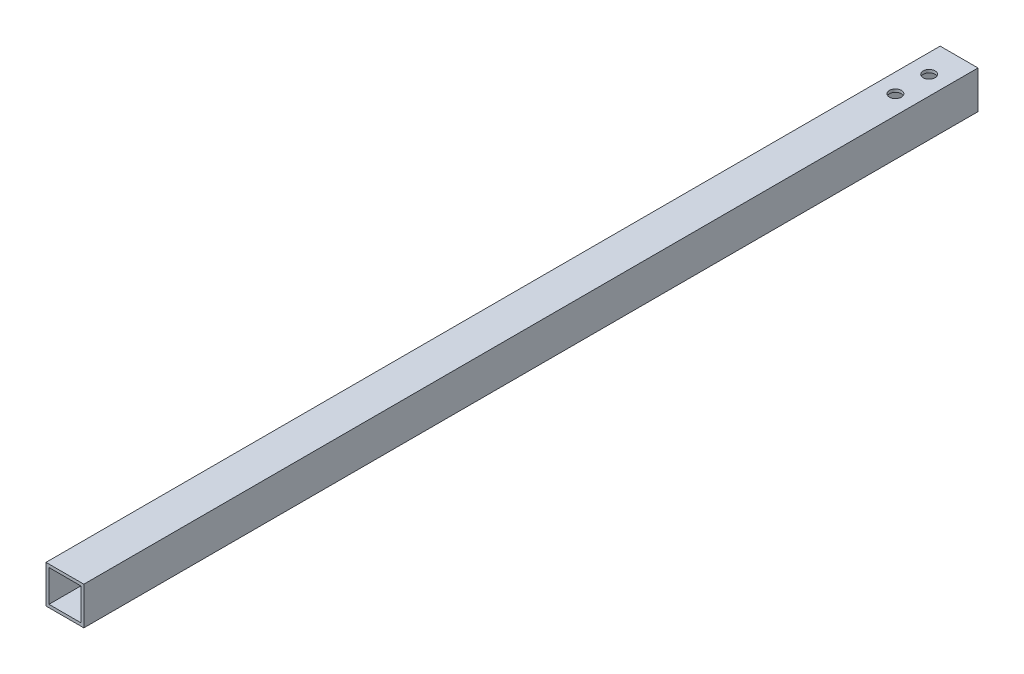
ISO-10303-21;
HEADER;
FILE_DESCRIPTION(('STEP AP214'),'2;1');
FILE_NAME('part.step','',(''),(''),'','','');
FILE_SCHEMA(('AUTOMOTIVE_DESIGN { 1 0 10303 214 1 1 1 1 }'));
ENDSEC;
DATA;
#1=APPLICATION_CONTEXT('core data for automotive mechanical design processes');
#2=APPLICATION_PROTOCOL_DEFINITION('international standard','automotive_design',2000,#1);
#3=PRODUCT_CONTEXT('',#1,'mechanical');
#4=PRODUCT('Part','Part','',(#3));
#5=PRODUCT_RELATED_PRODUCT_CATEGORY('part','',(#4));
#6=PRODUCT_DEFINITION_FORMATION('','',#4);
#7=PRODUCT_DEFINITION_CONTEXT('part definition',#1,'design');
#8=PRODUCT_DEFINITION('design','',#6,#7);
#9=PRODUCT_DEFINITION_SHAPE('','',#8);
#10=(LENGTH_UNIT() NAMED_UNIT(*) SI_UNIT(.MILLI.,.METRE.));
#11=(NAMED_UNIT(*) PLANE_ANGLE_UNIT() SI_UNIT($,.RADIAN.));
#12=(NAMED_UNIT(*) SI_UNIT($,.STERADIAN.) SOLID_ANGLE_UNIT());
#13=UNCERTAINTY_MEASURE_WITH_UNIT(LENGTH_MEASURE(1.E-05),#10,'distance_accuracy_value','');
#14=(GEOMETRIC_REPRESENTATION_CONTEXT(3) GLOBAL_UNCERTAINTY_ASSIGNED_CONTEXT((#13)) GLOBAL_UNIT_ASSIGNED_CONTEXT((#10,
#11,#12)) REPRESENTATION_CONTEXT('',''));
#15=CARTESIAN_POINT('',(0.,0.,0.));
#16=DIRECTION('',(0.,0.,1.));
#17=DIRECTION('',(1.,0.,0.));
#18=AXIS2_PLACEMENT_3D('',#15,#16,#17);
#19=CARTESIAN_POINT('',(-5.91608824086589,5.0490477402939,300.));
#20=DIRECTION('',(0.,1.,0.));
#21=DIRECTION('',(0.,0.,1.));
#22=AXIS2_PLACEMENT_3D('',#19,#20,#21);
#23=PLANE('',#22);
#24=CARTESIAN_POINT('',(0.433911759134113,5.0490477402939,10.0400407018049));
#25=DIRECTION('',(0.,1.,0.));
#26=DIRECTION('',(0.,0.,1.));
#27=AXIS2_PLACEMENT_3D('',#24,#25,#26);
#28=CIRCLE('',#27,2.);
#29=CARTESIAN_POINT('',(0.433911759134113,5.0490477402939,12.0400407018049));
#30=VERTEX_POINT('',#29);
#31=EDGE_CURVE('E165',#30,#30,#28,.T.);
#32=ORIENTED_EDGE('',*,*,#31,.F.);
#33=EDGE_LOOP('',(#32));
#34=FACE_BOUND('',#33,.T.);
#35=CARTESIAN_POINT('',(0.433911759134113,5.0490477402939,21.3484981501908));
#36=DIRECTION('',(0.,1.,0.));
#37=DIRECTION('',(0.,0.,1.));
#38=AXIS2_PLACEMENT_3D('',#35,#36,#37);
#39=CIRCLE('',#38,2.);
#40=CARTESIAN_POINT('',(0.433911759134113,5.0490477402939,23.3484981501908));
#41=VERTEX_POINT('',#40);
#42=EDGE_CURVE('E172',#41,#41,#39,.T.);
#43=ORIENTED_EDGE('',*,*,#42,.F.);
#44=EDGE_LOOP('',(#43));
#45=FACE_BOUND('',#44,.T.);
#46=DIRECTION('',(1.,0.,0.));
#47=VECTOR('',#46,1.);
#48=CARTESIAN_POINT('',(-5.91608824086589,5.0490477402939,0.));
#49=LINE('',#48,#47);
#50=CARTESIAN_POINT('',(-5.91608824086589,5.0490477402939,0.));
#51=VERTEX_POINT('',#50);
#52=CARTESIAN_POINT('',(6.78391175913411,5.0490477402939,0.));
#53=VERTEX_POINT('',#52);
#54=EDGE_CURVE('E148',#51,#53,#49,.T.);
#55=ORIENTED_EDGE('',*,*,#54,.F.);
#56=DIRECTION('',(0.,0.,-1.));
#57=VECTOR('',#56,1.);
#58=CARTESIAN_POINT('',(-5.91608824086589,5.0490477402939,300.));
#59=LINE('',#58,#57);
#60=CARTESIAN_POINT('',(-5.91608824086589,5.0490477402939,300.));
#61=VERTEX_POINT('',#60);
#62=EDGE_CURVE('E11',#61,#51,#59,.T.);
#63=ORIENTED_EDGE('',*,*,#62,.F.);
#64=DIRECTION('',(1.,0.,0.));
#65=VECTOR('',#64,1.);
#66=CARTESIAN_POINT('',(-5.91608824086589,5.0490477402939,300.));
#67=LINE('',#66,#65);
#68=CARTESIAN_POINT('',(6.78391175913411,5.0490477402939,300.));
#69=VERTEX_POINT('',#68);
#70=EDGE_CURVE('E136',#61,#69,#67,.T.);
#71=ORIENTED_EDGE('',*,*,#70,.T.);
#72=DIRECTION('',(0.,0.,-1.));
#73=VECTOR('',#72,1.);
#74=CARTESIAN_POINT('',(6.78391175913411,5.0490477402939,300.));
#75=LINE('',#74,#73);
#76=EDGE_CURVE('E147',#69,#53,#75,.T.);
#77=ORIENTED_EDGE('',*,*,#76,.T.);
#78=EDGE_LOOP('',(#55,#63,#71,#77));
#79=FACE_BOUND('',#78,.T.);
#80=ADVANCED_FACE('F37',(#34,#45,#79),#23,.T.);
#81=CARTESIAN_POINT('',(-5.91608824086589,5.0490477402939,300.));
#82=DIRECTION('',(1.,0.,0.));
#83=DIRECTION('',(0.,1.,0.));
#84=AXIS2_PLACEMENT_3D('',#81,#82,#83);
#85=PLANE('',#84);
#86=DIRECTION('',(0.,-1.,0.));
#87=VECTOR('',#86,1.);
#88=CARTESIAN_POINT('',(-5.91608824086589,5.0490477402939,0.));
#89=LINE('',#88,#87);
#90=CARTESIAN_POINT('',(-5.91608824086589,-7.6509522597061,0.));
#91=VERTEX_POINT('',#90);
#92=EDGE_CURVE('E140',#51,#91,#89,.T.);
#93=ORIENTED_EDGE('',*,*,#92,.T.);
#94=DIRECTION('',(0.,0.,-1.));
#95=VECTOR('',#94,1.);
#96=CARTESIAN_POINT('',(-5.91608824086589,-7.6509522597061,300.));
#97=LINE('',#96,#95);
#98=CARTESIAN_POINT('',(-5.91608824086589,-7.6509522597061,300.));
#99=VERTEX_POINT('',#98);
#100=EDGE_CURVE('E45',#99,#91,#97,.T.);
#101=ORIENTED_EDGE('',*,*,#100,.F.);
#102=DIRECTION('',(0.,-1.,0.));
#103=VECTOR('',#102,1.);
#104=CARTESIAN_POINT('',(-5.91608824086589,5.0490477402939,300.));
#105=LINE('',#104,#103);
#106=EDGE_CURVE('E145',#61,#99,#105,.T.);
#107=ORIENTED_EDGE('',*,*,#106,.F.);
#108=ORIENTED_EDGE('',*,*,#62,.T.);
#109=EDGE_LOOP('',(#93,#101,#107,#108));
#110=FACE_BOUND('',#109,.T.);
#111=ADVANCED_FACE('F207',(#110),#85,.F.);
#112=CARTESIAN_POINT('',(-5.91608824086589,-7.6509522597061,300.));
#113=DIRECTION('',(0.,1.,0.));
#114=DIRECTION('',(0.,0.,1.));
#115=AXIS2_PLACEMENT_3D('',#112,#113,#114);
#116=PLANE('',#115);
#117=CARTESIAN_POINT('',(0.433911759134113,-7.6509522597061,10.0400407018049));
#118=DIRECTION('',(0.,1.,0.));
#119=DIRECTION('',(0.,0.,1.));
#120=AXIS2_PLACEMENT_3D('',#117,#118,#119);
#121=CIRCLE('',#120,2.);
#122=CARTESIAN_POINT('',(0.433911759134113,-7.6509522597061,12.0400407018049));
#123=VERTEX_POINT('',#122);
#124=EDGE_CURVE('E120',#123,#123,#121,.T.);
#125=ORIENTED_EDGE('',*,*,#124,.T.);
#126=EDGE_LOOP('',(#125));
#127=FACE_BOUND('',#126,.T.);
#128=CARTESIAN_POINT('',(0.433911759134113,-7.6509522597061,21.3484981501908));
#129=DIRECTION('',(0.,1.,0.));
#130=DIRECTION('',(0.,0.,1.));
#131=AXIS2_PLACEMENT_3D('',#128,#129,#130);
#132=CIRCLE('',#131,2.);
#133=CARTESIAN_POINT('',(0.433911759134113,-7.6509522597061,23.3484981501908));
#134=VERTEX_POINT('',#133);
#135=EDGE_CURVE('E169',#134,#134,#132,.T.);
#136=ORIENTED_EDGE('',*,*,#135,.T.);
#137=EDGE_LOOP('',(#136));
#138=FACE_BOUND('',#137,.T.);
#139=DIRECTION('',(1.,0.,0.));
#140=VECTOR('',#139,1.);
#141=CARTESIAN_POINT('',(-5.91608824086589,-7.6509522597061,0.));
#142=LINE('',#141,#140);
#143=CARTESIAN_POINT('',(6.78391175913411,-7.6509522597061,0.));
#144=VERTEX_POINT('',#143);
#145=EDGE_CURVE('E154',#91,#144,#142,.T.);
#146=ORIENTED_EDGE('',*,*,#145,.T.);
#147=DIRECTION('',(0.,0.,-1.));
#148=VECTOR('',#147,1.);
#149=CARTESIAN_POINT('',(6.78391175913411,-7.6509522597061,300.));
#150=LINE('',#149,#148);
#151=CARTESIAN_POINT('',(6.78391175913411,-7.6509522597061,300.));
#152=VERTEX_POINT('',#151);
#153=EDGE_CURVE('E160',#152,#144,#150,.T.);
#154=ORIENTED_EDGE('',*,*,#153,.F.);
#155=DIRECTION('',(1.,0.,0.));
#156=VECTOR('',#155,1.);
#157=CARTESIAN_POINT('',(-5.91608824086589,-7.6509522597061,300.));
#158=LINE('',#157,#156);
#159=EDGE_CURVE('E143',#99,#152,#158,.T.);
#160=ORIENTED_EDGE('',*,*,#159,.F.);
#161=ORIENTED_EDGE('',*,*,#100,.T.);
#162=EDGE_LOOP('',(#146,#154,#160,#161));
#163=FACE_BOUND('',#162,.T.);
#164=ADVANCED_FACE('F212',(#127,#138,#163),#116,.F.);
#165=CARTESIAN_POINT('',(6.78391175913411,5.0490477402939,300.));
#166=DIRECTION('',(1.,0.,0.));
#167=DIRECTION('',(0.,0.,-1.));
#168=AXIS2_PLACEMENT_3D('',#165,#166,#167);
#169=PLANE('',#168);
#170=DIRECTION('',(0.,-1.,0.));
#171=VECTOR('',#170,1.);
#172=CARTESIAN_POINT('',(6.78391175913411,5.0490477402939,0.));
#173=LINE('',#172,#171);
#174=EDGE_CURVE('E151',#53,#144,#173,.T.);
#175=ORIENTED_EDGE('',*,*,#174,.F.);
#176=ORIENTED_EDGE('',*,*,#76,.F.);
#177=DIRECTION('',(0.,-1.,0.));
#178=VECTOR('',#177,1.);
#179=CARTESIAN_POINT('',(6.78391175913411,5.0490477402939,300.));
#180=LINE('',#179,#178);
#181=EDGE_CURVE('E139',#69,#152,#180,.T.);
#182=ORIENTED_EDGE('',*,*,#181,.T.);
#183=ORIENTED_EDGE('',*,*,#153,.T.);
#184=EDGE_LOOP('',(#175,#176,#182,#183));
#185=FACE_BOUND('',#184,.T.);
#186=ADVANCED_FACE('F230',(#185),#169,.T.);
#187=CARTESIAN_POINT('',(0.,0.,300.));
#188=DIRECTION('',(0.,0.,-1.));
#189=DIRECTION('',(-1.,0.,0.));
#190=AXIS2_PLACEMENT_3D('',#187,#188,#189);
#191=PLANE('',#190);
#192=DIRECTION('',(0.,-1.,0.));
#193=VECTOR('',#192,1.);
#194=CARTESIAN_POINT('',(-4.91608824086589,0.,300.));
#195=LINE('',#194,#193);
#196=CARTESIAN_POINT('',(-4.91608824086589,4.0490477402939,300.));
#197=VERTEX_POINT('',#196);
#198=CARTESIAN_POINT('',(-4.91608824086589,-6.6509522597061,300.));
#199=VERTEX_POINT('',#198);
#200=EDGE_CURVE('E111',#197,#199,#195,.T.);
#201=ORIENTED_EDGE('',*,*,#200,.F.);
#202=DIRECTION('',(1.,0.,0.));
#203=VECTOR('',#202,1.);
#204=CARTESIAN_POINT('',(0.,4.0490477402939,300.));
#205=LINE('',#204,#203);
#206=CARTESIAN_POINT('',(5.78391175913411,4.0490477402939,300.));
#207=VERTEX_POINT('',#206);
#208=EDGE_CURVE('E130',#197,#207,#205,.T.);
#209=ORIENTED_EDGE('',*,*,#208,.T.);
#210=DIRECTION('',(0.,-1.,0.));
#211=VECTOR('',#210,1.);
#212=CARTESIAN_POINT('',(5.78391175913411,0.,300.));
#213=LINE('',#212,#211);
#214=CARTESIAN_POINT('',(5.78391175913411,-6.6509522597061,300.));
#215=VERTEX_POINT('',#214);
#216=EDGE_CURVE('E107',#207,#215,#213,.T.);
#217=ORIENTED_EDGE('',*,*,#216,.T.);
#218=DIRECTION('',(1.,0.,0.));
#219=VECTOR('',#218,1.);
#220=CARTESIAN_POINT('',(0.,-6.6509522597061,300.));
#221=LINE('',#220,#219);
#222=EDGE_CURVE('E133',#199,#215,#221,.T.);
#223=ORIENTED_EDGE('',*,*,#222,.F.);
#224=EDGE_LOOP('',(#201,#209,#217,#223));
#225=FACE_BOUND('',#224,.T.);
#226=ORIENTED_EDGE('',*,*,#70,.F.);
#227=ORIENTED_EDGE('',*,*,#106,.T.);
#228=ORIENTED_EDGE('',*,*,#159,.T.);
#229=ORIENTED_EDGE('',*,*,#181,.F.);
#230=EDGE_LOOP('',(#226,#227,#228,#229));
#231=FACE_BOUND('',#230,.T.);
#232=ADVANCED_FACE('F192',(#225,#231),#191,.F.);
#233=CARTESIAN_POINT('',(0.,0.,0.));
#234=DIRECTION('',(0.,0.,-1.));
#235=DIRECTION('',(-1.,0.,0.));
#236=AXIS2_PLACEMENT_3D('',#233,#234,#235);
#237=PLANE('',#236);
#238=DIRECTION('',(1.,0.,0.));
#239=VECTOR('',#238,1.);
#240=CARTESIAN_POINT('',(0.,4.0490477402939,0.));
#241=LINE('',#240,#239);
#242=CARTESIAN_POINT('',(-4.91608824086589,4.0490477402939,0.));
#243=VERTEX_POINT('',#242);
#244=CARTESIAN_POINT('',(5.78391175913411,4.0490477402939,0.));
#245=VERTEX_POINT('',#244);
#246=EDGE_CURVE('E114',#243,#245,#241,.T.);
#247=ORIENTED_EDGE('',*,*,#246,.F.);
#248=DIRECTION('',(0.,-1.,0.));
#249=VECTOR('',#248,1.);
#250=CARTESIAN_POINT('',(-4.91608824086589,0.,0.));
#251=LINE('',#250,#249);
#252=CARTESIAN_POINT('',(-4.91608824086589,-6.6509522597061,0.));
#253=VERTEX_POINT('',#252);
#254=EDGE_CURVE('E125',#243,#253,#251,.T.);
#255=ORIENTED_EDGE('',*,*,#254,.T.);
#256=DIRECTION('',(1.,0.,0.));
#257=VECTOR('',#256,1.);
#258=CARTESIAN_POINT('',(0.,-6.6509522597061,0.));
#259=LINE('',#258,#257);
#260=CARTESIAN_POINT('',(5.78391175913411,-6.6509522597061,0.));
#261=VERTEX_POINT('',#260);
#262=EDGE_CURVE('E60',#253,#261,#259,.T.);
#263=ORIENTED_EDGE('',*,*,#262,.T.);
#264=DIRECTION('',(0.,-1.,0.));
#265=VECTOR('',#264,1.);
#266=CARTESIAN_POINT('',(5.78391175913411,0.,0.));
#267=LINE('',#266,#265);
#268=EDGE_CURVE('E105',#245,#261,#267,.T.);
#269=ORIENTED_EDGE('',*,*,#268,.F.);
#270=EDGE_LOOP('',(#247,#255,#263,#269));
#271=FACE_BOUND('',#270,.T.);
#272=ORIENTED_EDGE('',*,*,#54,.T.);
#273=ORIENTED_EDGE('',*,*,#174,.T.);
#274=ORIENTED_EDGE('',*,*,#145,.F.);
#275=ORIENTED_EDGE('',*,*,#92,.F.);
#276=EDGE_LOOP('',(#272,#273,#274,#275));
#277=FACE_BOUND('',#276,.T.);
#278=ADVANCED_FACE('F122',(#271,#277),#237,.T.);
#279=CARTESIAN_POINT('',(-5.91608824086589,4.0490477402939,300.));
#280=DIRECTION('',(0.,1.,0.));
#281=DIRECTION('',(0.,0.,1.));
#282=AXIS2_PLACEMENT_3D('',#279,#280,#281);
#283=PLANE('',#282);
#284=CARTESIAN_POINT('',(0.433911759134113,4.0490477402939,10.0400407018049));
#285=DIRECTION('',(0.,1.,0.));
#286=DIRECTION('',(0.,0.,1.));
#287=AXIS2_PLACEMENT_3D('',#284,#285,#286);
#288=CIRCLE('',#287,2.);
#289=CARTESIAN_POINT('',(0.433911759134113,4.0490477402939,12.0400407018049));
#290=VERTEX_POINT('',#289);
#291=EDGE_CURVE('E181',#290,#290,#288,.T.);
#292=ORIENTED_EDGE('',*,*,#291,.T.);
#293=EDGE_LOOP('',(#292));
#294=FACE_BOUND('',#293,.T.);
#295=CARTESIAN_POINT('',(0.433911759134113,4.0490477402939,21.3484981501908));
#296=DIRECTION('',(0.,1.,0.));
#297=DIRECTION('',(0.,0.,1.));
#298=AXIS2_PLACEMENT_3D('',#295,#296,#297);
#299=CIRCLE('',#298,2.);
#300=CARTESIAN_POINT('',(0.433911759134113,4.0490477402939,23.3484981501908));
#301=VERTEX_POINT('',#300);
#302=EDGE_CURVE('E164',#301,#301,#299,.T.);
#303=ORIENTED_EDGE('',*,*,#302,.T.);
#304=EDGE_LOOP('',(#303));
#305=FACE_BOUND('',#304,.T.);
#306=ORIENTED_EDGE('',*,*,#246,.T.);
#307=DIRECTION('',(0.,0.,-1.));
#308=VECTOR('',#307,1.);
#309=CARTESIAN_POINT('',(5.78391175913411,4.0490477402939,300.));
#310=LINE('',#309,#308);
#311=EDGE_CURVE('E101',#207,#245,#310,.T.);
#312=ORIENTED_EDGE('',*,*,#311,.F.);
#313=ORIENTED_EDGE('',*,*,#208,.F.);
#314=DIRECTION('',(0.,0.,-1.));
#315=VECTOR('',#314,1.);
#316=CARTESIAN_POINT('',(-4.91608824086589,4.0490477402939,300.));
#317=LINE('',#316,#315);
#318=EDGE_CURVE('E116',#197,#243,#317,.T.);
#319=ORIENTED_EDGE('',*,*,#318,.T.);
#320=EDGE_LOOP('',(#306,#312,#313,#319));
#321=FACE_BOUND('',#320,.T.);
#322=ADVANCED_FACE('F115',(#294,#305,#321),#283,.F.);
#323=CARTESIAN_POINT('',(-4.91608824086589,5.0490477402939,300.));
#324=DIRECTION('',(1.,0.,0.));
#325=DIRECTION('',(0.,1.,0.));
#326=AXIS2_PLACEMENT_3D('',#323,#324,#325);
#327=PLANE('',#326);
#328=ORIENTED_EDGE('',*,*,#254,.F.);
#329=ORIENTED_EDGE('',*,*,#318,.F.);
#330=ORIENTED_EDGE('',*,*,#200,.T.);
#331=DIRECTION('',(0.,0.,-1.));
#332=VECTOR('',#331,1.);
#333=CARTESIAN_POINT('',(-4.91608824086589,-6.6509522597061,300.));
#334=LINE('',#333,#332);
#335=EDGE_CURVE('E186',#199,#253,#334,.T.);
#336=ORIENTED_EDGE('',*,*,#335,.T.);
#337=EDGE_LOOP('',(#328,#329,#330,#336));
#338=FACE_BOUND('',#337,.T.);
#339=ADVANCED_FACE('F195',(#338),#327,.T.);
#340=CARTESIAN_POINT('',(-5.91608824086589,-6.6509522597061,300.));
#341=DIRECTION('',(0.,1.,0.));
#342=DIRECTION('',(0.,0.,1.));
#343=AXIS2_PLACEMENT_3D('',#340,#341,#342);
#344=PLANE('',#343);
#345=CARTESIAN_POINT('',(0.433911759134113,-6.6509522597061,10.0400407018049));
#346=DIRECTION('',(0.,1.,0.));
#347=DIRECTION('',(0.,0.,1.));
#348=AXIS2_PLACEMENT_3D('',#345,#346,#347);
#349=CIRCLE('',#348,2.);
#350=CARTESIAN_POINT('',(0.433911759134113,-6.6509522597061,12.0400407018049));
#351=VERTEX_POINT('',#350);
#352=EDGE_CURVE('E40',#351,#351,#349,.T.);
#353=ORIENTED_EDGE('',*,*,#352,.F.);
#354=EDGE_LOOP('',(#353));
#355=FACE_BOUND('',#354,.T.);
#356=CARTESIAN_POINT('',(0.433911759134113,-6.6509522597061,21.3484981501908));
#357=DIRECTION('',(0.,1.,0.));
#358=DIRECTION('',(0.,0.,1.));
#359=AXIS2_PLACEMENT_3D('',#356,#357,#358);
#360=CIRCLE('',#359,2.);
#361=CARTESIAN_POINT('',(0.433911759134113,-6.6509522597061,23.3484981501908));
#362=VERTEX_POINT('',#361);
#363=EDGE_CURVE('E162',#362,#362,#360,.T.);
#364=ORIENTED_EDGE('',*,*,#363,.F.);
#365=EDGE_LOOP('',(#364));
#366=FACE_BOUND('',#365,.T.);
#367=ORIENTED_EDGE('',*,*,#262,.F.);
#368=ORIENTED_EDGE('',*,*,#335,.F.);
#369=ORIENTED_EDGE('',*,*,#222,.T.);
#370=DIRECTION('',(0.,0.,-1.));
#371=VECTOR('',#370,1.);
#372=CARTESIAN_POINT('',(5.78391175913411,-6.6509522597061,300.));
#373=LINE('',#372,#371);
#374=EDGE_CURVE('E53',#215,#261,#373,.T.);
#375=ORIENTED_EDGE('',*,*,#374,.T.);
#376=EDGE_LOOP('',(#367,#368,#369,#375));
#377=FACE_BOUND('',#376,.T.);
#378=ADVANCED_FACE('F188',(#355,#366,#377),#344,.T.);
#379=CARTESIAN_POINT('',(5.78391175913411,5.0490477402939,300.));
#380=DIRECTION('',(1.,0.,0.));
#381=DIRECTION('',(0.,0.,-1.));
#382=AXIS2_PLACEMENT_3D('',#379,#380,#381);
#383=PLANE('',#382);
#384=ORIENTED_EDGE('',*,*,#268,.T.);
#385=ORIENTED_EDGE('',*,*,#374,.F.);
#386=ORIENTED_EDGE('',*,*,#216,.F.);
#387=ORIENTED_EDGE('',*,*,#311,.T.);
#388=EDGE_LOOP('',(#384,#385,#386,#387));
#389=FACE_BOUND('',#388,.T.);
#390=ADVANCED_FACE('F103',(#389),#383,.F.);
#391=CARTESIAN_POINT('',(0.433911759134113,-24.9509522597061,21.3484981501908));
#392=DIRECTION('',(0.,1.,0.));
#393=DIRECTION('',(0.,0.,1.));
#394=AXIS2_PLACEMENT_3D('',#391,#392,#393);
#395=CYLINDRICAL_SURFACE('',#394,2.);
#396=ORIENTED_EDGE('',*,*,#363,.T.);
#397=EDGE_LOOP('',(#396));
#398=FACE_BOUND('',#397,.T.);
#399=ORIENTED_EDGE('',*,*,#135,.F.);
#400=EDGE_LOOP('',(#399));
#401=FACE_BOUND('',#400,.T.);
#402=ADVANCED_FACE('F243',(#398,#401),#395,.F.);
#403=CARTESIAN_POINT('',(0.433911759134113,-24.9509522597061,10.0400407018049));
#404=DIRECTION('',(0.,1.,0.));
#405=DIRECTION('',(0.,0.,1.));
#406=AXIS2_PLACEMENT_3D('',#403,#404,#405);
#407=CYLINDRICAL_SURFACE('',#406,2.);
#408=ORIENTED_EDGE('',*,*,#352,.T.);
#409=EDGE_LOOP('',(#408));
#410=FACE_BOUND('',#409,.T.);
#411=ORIENTED_EDGE('',*,*,#124,.F.);
#412=EDGE_LOOP('',(#411));
#413=FACE_BOUND('',#412,.T.);
#414=ADVANCED_FACE('F247',(#410,#413),#407,.F.);
#415=ORIENTED_EDGE('',*,*,#42,.T.);
#416=EDGE_LOOP('',(#415));
#417=FACE_BOUND('',#416,.T.);
#418=ORIENTED_EDGE('',*,*,#302,.F.);
#419=EDGE_LOOP('',(#418));
#420=FACE_BOUND('',#419,.T.);
#421=ADVANCED_FACE('F249',(#417,#420),#395,.F.);
#422=ORIENTED_EDGE('',*,*,#31,.T.);
#423=EDGE_LOOP('',(#422));
#424=FACE_BOUND('',#423,.T.);
#425=ORIENTED_EDGE('',*,*,#291,.F.);
#426=EDGE_LOOP('',(#425));
#427=FACE_BOUND('',#426,.T.);
#428=ADVANCED_FACE('F255',(#424,#427),#407,.F.);
#429=CLOSED_SHELL('',(#80,#111,#164,#186,#232,#278,#322,#339,#378,#390,#402,#414,#421,#428));
#430=MANIFOLD_SOLID_BREP('B2',#429);
#431=ADVANCED_BREP_SHAPE_REPRESENTATION('',(#18,#430),#14);
#432=SHAPE_DEFINITION_REPRESENTATION(#9,#431);
ENDSEC;
END-ISO-10303-21;
